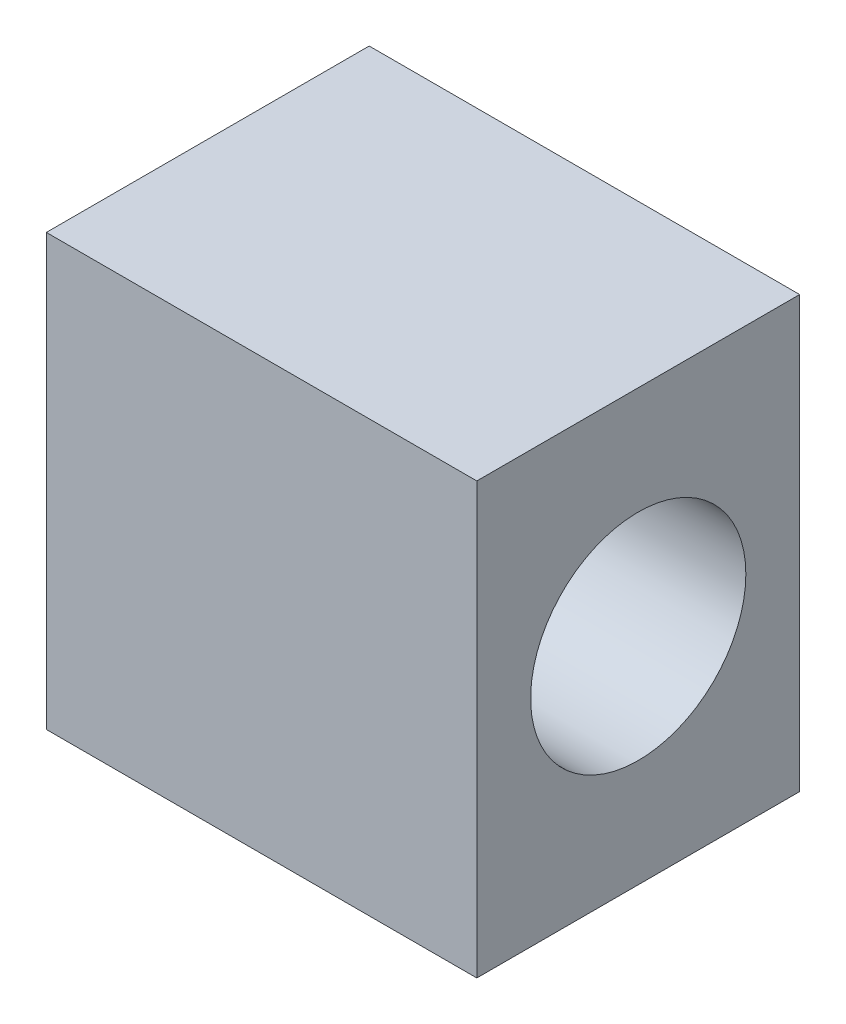
ISO-10303-21;
HEADER;
FILE_DESCRIPTION(('STEP AP214'),'2;1');
FILE_NAME('part.step','',(''),(''),'','','');
FILE_SCHEMA(('AUTOMOTIVE_DESIGN { 1 0 10303 214 1 1 1 1 }'));
ENDSEC;
DATA;
#1=APPLICATION_CONTEXT('core data for automotive mechanical design processes');
#2=APPLICATION_PROTOCOL_DEFINITION('international standard','automotive_design',2000,#1);
#3=PRODUCT_CONTEXT('',#1,'mechanical');
#4=PRODUCT('Part','Part','',(#3));
#5=PRODUCT_RELATED_PRODUCT_CATEGORY('part','',(#4));
#6=PRODUCT_DEFINITION_FORMATION('','',#4);
#7=PRODUCT_DEFINITION_CONTEXT('part definition',#1,'design');
#8=PRODUCT_DEFINITION('design','',#6,#7);
#9=PRODUCT_DEFINITION_SHAPE('','',#8);
#10=(LENGTH_UNIT() NAMED_UNIT(*) SI_UNIT(.MILLI.,.METRE.));
#11=(NAMED_UNIT(*) PLANE_ANGLE_UNIT() SI_UNIT($,.RADIAN.));
#12=(NAMED_UNIT(*) SI_UNIT($,.STERADIAN.) SOLID_ANGLE_UNIT());
#13=UNCERTAINTY_MEASURE_WITH_UNIT(LENGTH_MEASURE(1.E-05),#10,'distance_accuracy_value','');
#14=(GEOMETRIC_REPRESENTATION_CONTEXT(3) GLOBAL_UNCERTAINTY_ASSIGNED_CONTEXT((#13)) GLOBAL_UNIT_ASSIGNED_CONTEXT((#10,
#11,#12)) REPRESENTATION_CONTEXT('',''));
#15=CARTESIAN_POINT('',(0.,0.,0.));
#16=DIRECTION('',(0.,0.,1.));
#17=DIRECTION('',(1.,0.,0.));
#18=AXIS2_PLACEMENT_3D('',#15,#16,#17);
#19=CARTESIAN_POINT('',(10.,20.,7.5));
#20=DIRECTION('',(-1.,0.,0.));
#21=DIRECTION('',(0.,0.,1.));
#22=AXIS2_PLACEMENT_3D('',#19,#20,#21);
#23=PLANE('',#22);
#24=CARTESIAN_POINT('',(10.,10.,0.));
#25=DIRECTION('',(1.,0.,0.));
#26=DIRECTION('',(0.,0.,-1.));
#27=AXIS2_PLACEMENT_3D('',#24,#25,#26);
#28=CIRCLE('',#27,5.);
#29=CARTESIAN_POINT('',(10.,10.,-5.));
#30=VERTEX_POINT('',#29);
#31=EDGE_CURVE('E128',#30,#30,#28,.T.);
#32=ORIENTED_EDGE('',*,*,#31,.F.);
#33=EDGE_LOOP('',(#32));
#34=FACE_BOUND('',#33,.T.);
#35=DIRECTION('',(0.,0.,-1.));
#36=VECTOR('',#35,1.);
#37=CARTESIAN_POINT('',(10.,0.,7.5));
#38=LINE('',#37,#36);
#39=CARTESIAN_POINT('',(10.,0.,7.5));
#40=VERTEX_POINT('',#39);
#41=CARTESIAN_POINT('',(10.,0.,-7.5));
#42=VERTEX_POINT('',#41);
#43=EDGE_CURVE('E107',#40,#42,#38,.T.);
#44=ORIENTED_EDGE('',*,*,#43,.T.);
#45=DIRECTION('',(0.,-1.,0.));
#46=VECTOR('',#45,1.);
#47=CARTESIAN_POINT('',(10.,20.,-7.5));
#48=LINE('',#47,#46);
#49=CARTESIAN_POINT('',(10.,20.,-7.5));
#50=VERTEX_POINT('',#49);
#51=EDGE_CURVE('E11',#50,#42,#48,.T.);
#52=ORIENTED_EDGE('',*,*,#51,.F.);
#53=DIRECTION('',(0.,0.,-1.));
#54=VECTOR('',#53,1.);
#55=CARTESIAN_POINT('',(10.,20.,7.5));
#56=LINE('',#55,#54);
#57=CARTESIAN_POINT('',(10.,20.,7.5));
#58=VERTEX_POINT('',#57);
#59=EDGE_CURVE('E91',#58,#50,#56,.T.);
#60=ORIENTED_EDGE('',*,*,#59,.F.);
#61=DIRECTION('',(0.,-1.,0.));
#62=VECTOR('',#61,1.);
#63=CARTESIAN_POINT('',(10.,20.,7.5));
#64=LINE('',#63,#62);
#65=EDGE_CURVE('E103',#58,#40,#64,.T.);
#66=ORIENTED_EDGE('',*,*,#65,.T.);
#67=EDGE_LOOP('',(#44,#52,#60,#66));
#68=FACE_BOUND('',#67,.T.);
#69=ADVANCED_FACE('F39',(#34,#68),#23,.F.);
#70=CARTESIAN_POINT('',(-10.,20.,-7.5));
#71=DIRECTION('',(0.,0.,1.));
#72=DIRECTION('',(1.,0.,0.));
#73=AXIS2_PLACEMENT_3D('',#70,#71,#72);
#74=PLANE('',#73);
#75=DIRECTION('',(-1.,0.,0.));
#76=VECTOR('',#75,1.);
#77=CARTESIAN_POINT('',(-10.,0.,-7.5));
#78=LINE('',#77,#76);
#79=CARTESIAN_POINT('',(-10.,0.,-7.5));
#80=VERTEX_POINT('',#79);
#81=EDGE_CURVE('E96',#42,#80,#78,.T.);
#82=ORIENTED_EDGE('',*,*,#81,.T.);
#83=DIRECTION('',(0.,-1.,0.));
#84=VECTOR('',#83,1.);
#85=CARTESIAN_POINT('',(-10.,20.,-7.5));
#86=LINE('',#85,#84);
#87=CARTESIAN_POINT('',(-10.,20.,-7.5));
#88=VERTEX_POINT('',#87);
#89=EDGE_CURVE('E48',#88,#80,#86,.T.);
#90=ORIENTED_EDGE('',*,*,#89,.F.);
#91=DIRECTION('',(-1.,0.,0.));
#92=VECTOR('',#91,1.);
#93=CARTESIAN_POINT('',(-10.,20.,-7.5));
#94=LINE('',#93,#92);
#95=EDGE_CURVE('E86',#50,#88,#94,.T.);
#96=ORIENTED_EDGE('',*,*,#95,.F.);
#97=ORIENTED_EDGE('',*,*,#51,.T.);
#98=EDGE_LOOP('',(#82,#90,#96,#97));
#99=FACE_BOUND('',#98,.T.);
#100=ADVANCED_FACE('F95',(#99),#74,.F.);
#101=CARTESIAN_POINT('',(-10.,20.,-7.5));
#102=DIRECTION('',(1.,0.,0.));
#103=DIRECTION('',(0.,0.,-1.));
#104=AXIS2_PLACEMENT_3D('',#101,#102,#103);
#105=PLANE('',#104);
#106=CARTESIAN_POINT('',(-10.,10.,0.));
#107=DIRECTION('',(-1.,0.,0.));
#108=DIRECTION('',(0.,0.,1.));
#109=AXIS2_PLACEMENT_3D('',#106,#107,#108);
#110=CIRCLE('',#109,5.);
#111=CARTESIAN_POINT('',(-10.,10.,5.));
#112=VERTEX_POINT('',#111);
#113=EDGE_CURVE('E136',#112,#112,#110,.T.);
#114=ORIENTED_EDGE('',*,*,#113,.F.);
#115=EDGE_LOOP('',(#114));
#116=FACE_BOUND('',#115,.T.);
#117=DIRECTION('',(0.,0.,1.));
#118=VECTOR('',#117,1.);
#119=CARTESIAN_POINT('',(-10.,0.,-7.5));
#120=LINE('',#119,#118);
#121=CARTESIAN_POINT('',(-10.,0.,7.5));
#122=VERTEX_POINT('',#121);
#123=EDGE_CURVE('E73',#80,#122,#120,.T.);
#124=ORIENTED_EDGE('',*,*,#123,.T.);
#125=DIRECTION('',(0.,-1.,0.));
#126=VECTOR('',#125,1.);
#127=CARTESIAN_POINT('',(-10.,20.,7.5));
#128=LINE('',#127,#126);
#129=CARTESIAN_POINT('',(-10.,20.,7.5));
#130=VERTEX_POINT('',#129);
#131=EDGE_CURVE('E98',#130,#122,#128,.T.);
#132=ORIENTED_EDGE('',*,*,#131,.F.);
#133=DIRECTION('',(0.,0.,1.));
#134=VECTOR('',#133,1.);
#135=CARTESIAN_POINT('',(-10.,20.,-7.5));
#136=LINE('',#135,#134);
#137=EDGE_CURVE('E89',#88,#130,#136,.T.);
#138=ORIENTED_EDGE('',*,*,#137,.F.);
#139=ORIENTED_EDGE('',*,*,#89,.T.);
#140=EDGE_LOOP('',(#124,#132,#138,#139));
#141=FACE_BOUND('',#140,.T.);
#142=ADVANCED_FACE('F99',(#116,#141),#105,.F.);
#143=CARTESIAN_POINT('',(-10.,20.,7.5));
#144=DIRECTION('',(0.,0.,-1.));
#145=DIRECTION('',(-1.,0.,0.));
#146=AXIS2_PLACEMENT_3D('',#143,#144,#145);
#147=PLANE('',#146);
#148=DIRECTION('',(1.,0.,0.));
#149=VECTOR('',#148,1.);
#150=CARTESIAN_POINT('',(-10.,0.,7.5));
#151=LINE('',#150,#149);
#152=EDGE_CURVE('E79',#122,#40,#151,.T.);
#153=ORIENTED_EDGE('',*,*,#152,.T.);
#154=ORIENTED_EDGE('',*,*,#65,.F.);
#155=DIRECTION('',(1.,0.,0.));
#156=VECTOR('',#155,1.);
#157=CARTESIAN_POINT('',(-10.,20.,7.5));
#158=LINE('',#157,#156);
#159=EDGE_CURVE('E56',#130,#58,#158,.T.);
#160=ORIENTED_EDGE('',*,*,#159,.F.);
#161=ORIENTED_EDGE('',*,*,#131,.T.);
#162=EDGE_LOOP('',(#153,#154,#160,#161));
#163=FACE_BOUND('',#162,.T.);
#164=ADVANCED_FACE('F121',(#163),#147,.F.);
#165=CARTESIAN_POINT('',(0.,20.,0.));
#166=DIRECTION('',(0.,-1.,0.));
#167=DIRECTION('',(0.,0.,-1.));
#168=AXIS2_PLACEMENT_3D('',#165,#166,#167);
#169=PLANE('',#168);
#170=ORIENTED_EDGE('',*,*,#59,.T.);
#171=ORIENTED_EDGE('',*,*,#95,.T.);
#172=ORIENTED_EDGE('',*,*,#137,.T.);
#173=ORIENTED_EDGE('',*,*,#159,.T.);
#174=EDGE_LOOP('',(#170,#171,#172,#173));
#175=FACE_BOUND('',#174,.T.);
#176=ADVANCED_FACE('F87',(#175),#169,.F.);
#177=CARTESIAN_POINT('',(0.,0.,0.));
#178=DIRECTION('',(0.,-1.,0.));
#179=DIRECTION('',(0.,0.,-1.));
#180=AXIS2_PLACEMENT_3D('',#177,#178,#179);
#181=PLANE('',#180);
#182=ORIENTED_EDGE('',*,*,#43,.F.);
#183=ORIENTED_EDGE('',*,*,#152,.F.);
#184=ORIENTED_EDGE('',*,*,#123,.F.);
#185=ORIENTED_EDGE('',*,*,#81,.F.);
#186=EDGE_LOOP('',(#182,#183,#184,#185));
#187=FACE_BOUND('',#186,.T.);
#188=ADVANCED_FACE('F124',(#187),#181,.T.);
#189=CARTESIAN_POINT('',(0.,10.,0.));
#190=DIRECTION('',(1.,0.,0.));
#191=DIRECTION('',(0.,0.,-1.));
#192=AXIS2_PLACEMENT_3D('',#189,#190,#191);
#193=CYLINDRICAL_SURFACE('',#192,5.);
#194=CARTESIAN_POINT('',(0.,10.,0.));
#195=DIRECTION('',(1.,0.,0.));
#196=DIRECTION('',(0.,0.,-1.));
#197=AXIS2_PLACEMENT_3D('',#194,#195,#196);
#198=CIRCLE('',#197,5.);
#199=CARTESIAN_POINT('',(0.,10.,-5.));
#200=VERTEX_POINT('',#199);
#201=EDGE_CURVE('E111',#200,#200,#198,.T.);
#202=ORIENTED_EDGE('',*,*,#201,.F.);
#203=EDGE_LOOP('',(#202));
#204=FACE_BOUND('',#203,.T.);
#205=ORIENTED_EDGE('',*,*,#31,.T.);
#206=EDGE_LOOP('',(#205));
#207=FACE_BOUND('',#206,.T.);
#208=ADVANCED_FACE('F166',(#204,#207),#193,.F.);
#209=CARTESIAN_POINT('',(0.,10.,0.));
#210=DIRECTION('',(1.,0.,0.));
#211=DIRECTION('',(0.,0.,-1.));
#212=AXIS2_PLACEMENT_3D('',#209,#210,#211);
#213=PLANE('',#212);
#214=ORIENTED_EDGE('',*,*,#201,.T.);
#215=EDGE_LOOP('',(#214));
#216=FACE_BOUND('',#215,.T.);
#217=ADVANCED_FACE('F149',(#216),#213,.T.);
#218=CARTESIAN_POINT('',(-6.,10.,0.));
#219=DIRECTION('',(-1.,0.,0.));
#220=DIRECTION('',(0.,0.,1.));
#221=AXIS2_PLACEMENT_3D('',#218,#219,#220);
#222=CYLINDRICAL_SURFACE('',#221,5.);
#223=CARTESIAN_POINT('',(-6.,10.,0.));
#224=DIRECTION('',(-1.,0.,0.));
#225=DIRECTION('',(0.,0.,1.));
#226=AXIS2_PLACEMENT_3D('',#223,#224,#225);
#227=CIRCLE('',#226,5.);
#228=CARTESIAN_POINT('',(-6.,10.,5.));
#229=VERTEX_POINT('',#228);
#230=EDGE_CURVE('E132',#229,#229,#227,.T.);
#231=ORIENTED_EDGE('',*,*,#230,.F.);
#232=EDGE_LOOP('',(#231));
#233=FACE_BOUND('',#232,.T.);
#234=ORIENTED_EDGE('',*,*,#113,.T.);
#235=EDGE_LOOP('',(#234));
#236=FACE_BOUND('',#235,.T.);
#237=ADVANCED_FACE('F146',(#233,#236),#222,.F.);
#238=CARTESIAN_POINT('',(-6.,10.,0.));
#239=DIRECTION('',(-1.,0.,0.));
#240=DIRECTION('',(0.,0.,1.));
#241=AXIS2_PLACEMENT_3D('',#238,#239,#240);
#242=PLANE('',#241);
#243=ORIENTED_EDGE('',*,*,#230,.T.);
#244=EDGE_LOOP('',(#243));
#245=FACE_BOUND('',#244,.T.);
#246=ADVANCED_FACE('F144',(#245),#242,.T.);
#247=CLOSED_SHELL('',(#69,#100,#142,#164,#176,#188,#208,#217,#237,#246));
#248=MANIFOLD_SOLID_BREP('B2',#247);
#249=ADVANCED_BREP_SHAPE_REPRESENTATION('',(#18,#248),#14);
#250=SHAPE_DEFINITION_REPRESENTATION(#9,#249);
ENDSEC;
END-ISO-10303-21;
